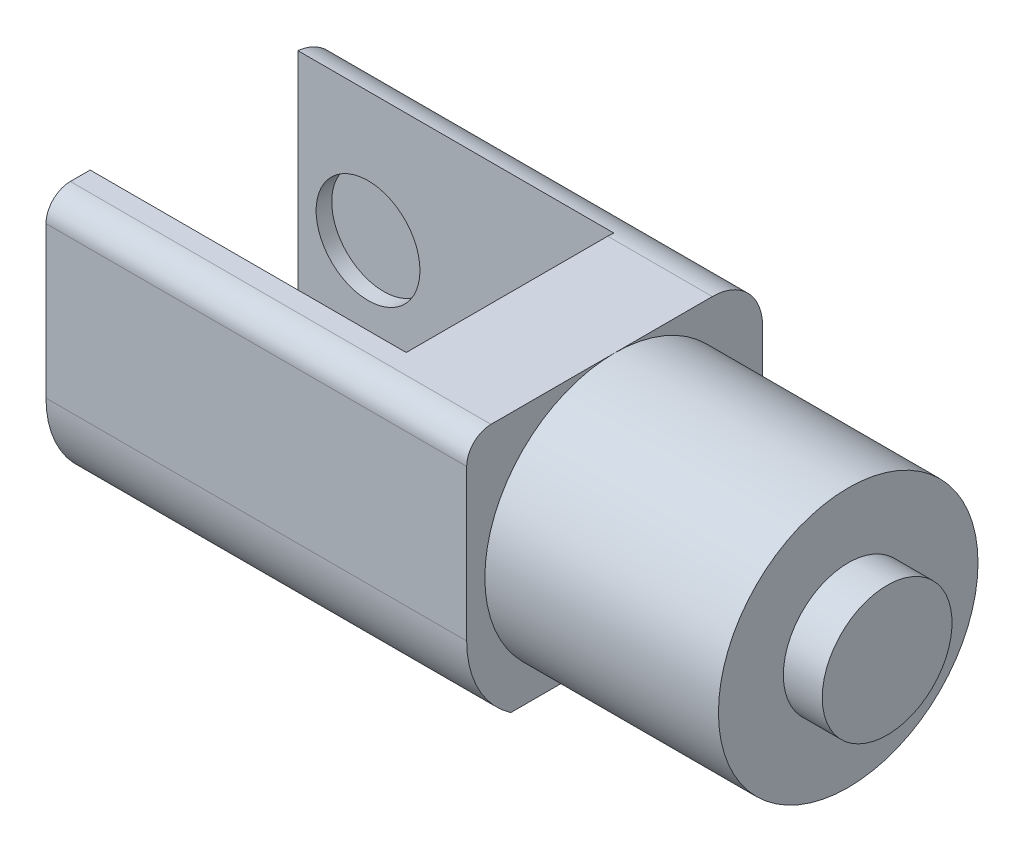
ISO-10303-21;
HEADER;
FILE_DESCRIPTION(('STEP AP214'),'2;1');
FILE_NAME('part.step','',(''),(''),'','','');
FILE_SCHEMA(('AUTOMOTIVE_DESIGN { 1 0 10303 214 1 1 1 1 }'));
ENDSEC;
DATA;
#1=APPLICATION_CONTEXT('core data for automotive mechanical design processes');
#2=APPLICATION_PROTOCOL_DEFINITION('international standard','automotive_design',2000,#1);
#3=PRODUCT_CONTEXT('',#1,'mechanical');
#4=PRODUCT('Part','Part','',(#3));
#5=PRODUCT_RELATED_PRODUCT_CATEGORY('part','',(#4));
#6=PRODUCT_DEFINITION_FORMATION('','',#4);
#7=PRODUCT_DEFINITION_CONTEXT('part definition',#1,'design');
#8=PRODUCT_DEFINITION('design','',#6,#7);
#9=PRODUCT_DEFINITION_SHAPE('','',#8);
#10=(LENGTH_UNIT() NAMED_UNIT(*) SI_UNIT(.MILLI.,.METRE.));
#11=(NAMED_UNIT(*) PLANE_ANGLE_UNIT() SI_UNIT($,.RADIAN.));
#12=(NAMED_UNIT(*) SI_UNIT($,.STERADIAN.) SOLID_ANGLE_UNIT());
#13=UNCERTAINTY_MEASURE_WITH_UNIT(LENGTH_MEASURE(1.E-05),#10,'distance_accuracy_value','');
#14=(GEOMETRIC_REPRESENTATION_CONTEXT(3) GLOBAL_UNCERTAINTY_ASSIGNED_CONTEXT((#13)) GLOBAL_UNIT_ASSIGNED_CONTEXT((#10,
#11,#12)) REPRESENTATION_CONTEXT('',''));
#15=CARTESIAN_POINT('',(0.,0.,0.));
#16=DIRECTION('',(0.,0.,1.));
#17=DIRECTION('',(1.,0.,0.));
#18=AXIS2_PLACEMENT_3D('',#15,#16,#17);
#19=CARTESIAN_POINT('',(22.86,0.,0.));
#20=DIRECTION('',(-1.,0.,0.));
#21=DIRECTION('',(0.,0.,1.));
#22=AXIS2_PLACEMENT_3D('',#19,#20,#21);
#23=CYLINDRICAL_SURFACE('',#22,12.7);
#24=CARTESIAN_POINT('',(22.86,0.,0.));
#25=DIRECTION('',(1.,0.,0.));
#26=DIRECTION('',(0.,0.,-1.));
#27=AXIS2_PLACEMENT_3D('',#24,#25,#26);
#28=CIRCLE('',#27,12.7);
#29=CARTESIAN_POINT('',(22.86,0.,-12.7));
#30=VERTEX_POINT('',#29);
#31=EDGE_CURVE('E178',#30,#30,#28,.T.);
#32=ORIENTED_EDGE('',*,*,#31,.F.);
#33=EDGE_LOOP('',(#32));
#34=FACE_BOUND('',#33,.T.);
#35=CARTESIAN_POINT('',(0.,0.,0.));
#36=DIRECTION('',(1.,0.,0.));
#37=DIRECTION('',(0.,0.,-1.));
#38=AXIS2_PLACEMENT_3D('',#35,#36,#37);
#39=CIRCLE('',#38,12.7);
#40=CARTESIAN_POINT('',(0.,12.7,0.));
#41=VERTEX_POINT('',#40);
#42=CARTESIAN_POINT('',(0.,-12.7,0.));
#43=VERTEX_POINT('',#42);
#44=EDGE_CURVE('E181',#41,#43,#39,.T.);
#45=ORIENTED_EDGE('',*,*,#44,.T.);
#46=EDGE_CURVE('E173',#43,#41,#39,.T.);
#47=ORIENTED_EDGE('',*,*,#46,.T.);
#48=EDGE_LOOP('',(#45,#47));
#49=FACE_BOUND('',#48,.T.);
#50=ADVANCED_FACE('F36',(#34,#49),#23,.T.);
#51=CARTESIAN_POINT('',(22.86,0.,0.));
#52=DIRECTION('',(1.,0.,0.));
#53=DIRECTION('',(0.,0.,-1.));
#54=AXIS2_PLACEMENT_3D('',#51,#52,#53);
#55=PLANE('',#54);
#56=CARTESIAN_POINT('',(22.86,0.,0.));
#57=DIRECTION('',(1.,0.,0.));
#58=DIRECTION('',(0.,0.,-1.));
#59=AXIS2_PLACEMENT_3D('',#56,#57,#58);
#60=CIRCLE('',#59,6.35);
#61=CARTESIAN_POINT('',(22.86,0.,6.35));
#62=VERTEX_POINT('',#61);
#63=EDGE_CURVE('E174',#62,#62,#60,.T.);
#64=ORIENTED_EDGE('',*,*,#63,.F.);
#65=EDGE_LOOP('',(#64));
#66=FACE_BOUND('',#65,.T.);
#67=ORIENTED_EDGE('',*,*,#31,.T.);
#68=EDGE_LOOP('',(#67));
#69=FACE_BOUND('',#68,.T.);
#70=ADVANCED_FACE('F292',(#66,#69),#55,.T.);
#71=CARTESIAN_POINT('',(26.67,0.,0.));
#72=DIRECTION('',(-1.,0.,0.));
#73=DIRECTION('',(0.,0.,1.));
#74=AXIS2_PLACEMENT_3D('',#71,#72,#73);
#75=CYLINDRICAL_SURFACE('',#74,6.35);
#76=CARTESIAN_POINT('',(26.67,0.,0.));
#77=DIRECTION('',(1.,0.,0.));
#78=DIRECTION('',(0.,0.,-1.));
#79=AXIS2_PLACEMENT_3D('',#76,#77,#78);
#80=CIRCLE('',#79,6.35);
#81=CARTESIAN_POINT('',(26.67,0.,6.35));
#82=VERTEX_POINT('',#81);
#83=EDGE_CURVE('E170',#82,#82,#80,.T.);
#84=CARTESIAN_POINT('',(26.67,0.,6.35));
#85=CARTESIAN_POINT('',(26.6303125,0.,6.35));
#86=CARTESIAN_POINT('',(26.590625,0.,6.35));
#87=CARTESIAN_POINT('',(26.51125,0.,6.35));
#88=CARTESIAN_POINT('',(26.4715625,0.,6.35));
#89=CARTESIAN_POINT('',(26.3921875,0.,6.35));
#90=CARTESIAN_POINT('',(26.3525,0.,6.35));
#91=CARTESIAN_POINT('',(26.273125,0.,6.35));
#92=CARTESIAN_POINT('',(26.2334375,0.,6.35));
#93=CARTESIAN_POINT('',(26.1540625,0.,6.35));
#94=CARTESIAN_POINT('',(26.114375,0.,6.35));
#95=CARTESIAN_POINT('',(26.035,0.,6.35));
#96=CARTESIAN_POINT('',(25.9953125,0.,6.35));
#97=CARTESIAN_POINT('',(25.9159375,0.,6.35));
#98=CARTESIAN_POINT('',(25.87625,0.,6.35));
#99=CARTESIAN_POINT('',(25.796875,0.,6.35));
#100=CARTESIAN_POINT('',(25.7571875,0.,6.35));
#101=CARTESIAN_POINT('',(25.6778125,0.,6.35));
#102=CARTESIAN_POINT('',(25.638125,0.,6.35));
#103=CARTESIAN_POINT('',(25.55875,0.,6.35));
#104=CARTESIAN_POINT('',(25.5190625,0.,6.35));
#105=CARTESIAN_POINT('',(25.4396875,0.,6.35));
#106=CARTESIAN_POINT('',(25.4,0.,6.35));
#107=CARTESIAN_POINT('',(25.320625,0.,6.35));
#108=CARTESIAN_POINT('',(25.2809375,0.,6.35));
#109=CARTESIAN_POINT('',(25.2015625,0.,6.35));
#110=CARTESIAN_POINT('',(25.161875,0.,6.35));
#111=CARTESIAN_POINT('',(25.0825,0.,6.35));
#112=CARTESIAN_POINT('',(25.0428125,0.,6.35));
#113=CARTESIAN_POINT('',(24.9634375,0.,6.35));
#114=CARTESIAN_POINT('',(24.92375,0.,6.35));
#115=CARTESIAN_POINT('',(24.844375,0.,6.35));
#116=CARTESIAN_POINT('',(24.8046875,0.,6.35));
#117=CARTESIAN_POINT('',(24.7253125,0.,6.35));
#118=CARTESIAN_POINT('',(24.685625,0.,6.35));
#119=CARTESIAN_POINT('',(24.60625,0.,6.35));
#120=CARTESIAN_POINT('',(24.5665625,0.,6.35));
#121=CARTESIAN_POINT('',(24.4871875,0.,6.35));
#122=CARTESIAN_POINT('',(24.4475,0.,6.35));
#123=CARTESIAN_POINT('',(24.368125,0.,6.35));
#124=CARTESIAN_POINT('',(24.3284375,0.,6.35));
#125=CARTESIAN_POINT('',(24.2490625,0.,6.35));
#126=CARTESIAN_POINT('',(24.209375,0.,6.35));
#127=CARTESIAN_POINT('',(24.13,0.,6.35));
#128=CARTESIAN_POINT('',(24.0903125,0.,6.35));
#129=CARTESIAN_POINT('',(24.0109375,0.,6.35));
#130=CARTESIAN_POINT('',(23.97125,0.,6.35));
#131=CARTESIAN_POINT('',(23.891875,0.,6.35));
#132=CARTESIAN_POINT('',(23.8521875,0.,6.35));
#133=CARTESIAN_POINT('',(23.7728125,0.,6.35));
#134=CARTESIAN_POINT('',(23.733125,0.,6.35));
#135=CARTESIAN_POINT('',(23.65375,0.,6.35));
#136=CARTESIAN_POINT('',(23.6140625,0.,6.35));
#137=CARTESIAN_POINT('',(23.5346875,0.,6.35));
#138=CARTESIAN_POINT('',(23.495,0.,6.35));
#139=CARTESIAN_POINT('',(23.415625,0.,6.35));
#140=CARTESIAN_POINT('',(23.3759375,0.,6.35));
#141=CARTESIAN_POINT('',(23.2965625,0.,6.35));
#142=CARTESIAN_POINT('',(23.256875,0.,6.35));
#143=CARTESIAN_POINT('',(23.1775,0.,6.35));
#144=CARTESIAN_POINT('',(23.1378125,0.,6.35));
#145=CARTESIAN_POINT('',(23.0584375,0.,6.35));
#146=CARTESIAN_POINT('',(23.01875,0.,6.35));
#147=CARTESIAN_POINT('',(22.939375,0.,6.35));
#148=CARTESIAN_POINT('',(22.8996875,0.,6.35));
#149=CARTESIAN_POINT('',(22.86,0.,6.35));
#150=B_SPLINE_CURVE_WITH_KNOTS('',3,(#84,#85,#86,#87,#88,#89,#90,#91,#92,#93,#94,#95,#96,#97,
#98,#99,#100,#101,#102,#103,#104,#105,#106,#107,#108,#109,#110,#111,#112,#113,#114,#115,#116,
#117,#118,#119,#120,#121,#122,#123,#124,#125,#126,#127,#128,#129,#130,#131,#132,#133,#134,#135,
#136,#137,#138,#139,#140,#141,#142,#143,#144,#145,#146,#147,#148,#149),.UNSPECIFIED.,.F.,.F.,(4,
2,2,2,2,2,2,2,2,2,2,2,2,2,2,2,2,2,2,2,2,2,2,2,2,2,2,2,2,2,2,2,4),(0.,0.119062500000003,
0.238125000000002,0.357187500000002,0.476250000000001,0.5953125,0.714375000000003,
0.833437500000003,0.952500000000002,1.0715625,1.190625,1.3096875,1.42875,1.5478125,1.666875,
1.7859375,1.905,2.0240625,2.143125,2.2621875,2.38125,2.5003125,2.619375,2.7384375,2.8575,
2.9765625,3.095625,3.2146875,3.33375,3.4528125,3.571875,3.6909375,3.81),.UNSPECIFIED.);
#151=EDGE_CURVE('BSEAM298',#82,#62,#150,.T.);
#152=ORIENTED_EDGE('',*,*,#83,.F.);
#153=ORIENTED_EDGE('',*,*,#63,.T.);
#154=ORIENTED_EDGE('',*,*,#151,.T.);
#155=ORIENTED_EDGE('',*,*,#151,.F.);
#156=EDGE_LOOP('',(#152,#154,#153,#155));
#157=FACE_BOUND('',#156,.T.);
#158=ADVANCED_FACE('F298',(#157),#75,.T.);
#159=CARTESIAN_POINT('',(26.67,0.,0.));
#160=DIRECTION('',(1.,0.,0.));
#161=DIRECTION('',(0.,0.,-1.));
#162=AXIS2_PLACEMENT_3D('',#159,#160,#161);
#163=PLANE('',#162);
#164=ORIENTED_EDGE('',*,*,#83,.T.);
#165=EDGE_LOOP('',(#164));
#166=FACE_BOUND('',#165,.T.);
#167=ADVANCED_FACE('F365',(#166),#163,.T.);
#168=CARTESIAN_POINT('',(0.,12.7,14.478));
#169=DIRECTION('',(-1.,0.,0.));
#170=DIRECTION('',(0.,0.,1.));
#171=AXIS2_PLACEMENT_3D('',#168,#169,#170);
#172=PLANE('',#171);
#173=DIRECTION('',(0.,1.,0.));
#174=VECTOR('',#173,1.);
#175=CARTESIAN_POINT('',(0.,12.7,14.478));
#176=LINE('',#175,#174);
#177=CARTESIAN_POINT('',(0.,-4.47109509108289,14.478));
#178=VERTEX_POINT('',#177);
#179=CARTESIAN_POINT('',(0.,10.319999934,14.478));
#180=VERTEX_POINT('',#179);
#181=EDGE_CURVE('E164',#178,#180,#176,.T.);
#182=ORIENTED_EDGE('',*,*,#181,.F.);
#183=CARTESIAN_POINT('',(0.,-4.47109509108289,4.478));
#184=DIRECTION('',(-1.,0.,0.));
#185=DIRECTION('',(0.,0.,1.));
#186=AXIS2_PLACEMENT_3D('',#183,#184,#185);
#187=CIRCLE('',#186,10.);
#188=CARTESIAN_POINT('',(0.,-12.7,10.16));
#189=VERTEX_POINT('',#188);
#190=EDGE_CURVE('E196',#178,#189,#187,.F.);
#191=ORIENTED_EDGE('',*,*,#190,.T.);
#192=DIRECTION('',(0.,0.,1.));
#193=VECTOR('',#192,1.);
#194=CARTESIAN_POINT('',(0.,-12.7,-10.16));
#195=LINE('',#194,#193);
#196=EDGE_CURVE('E157',#43,#189,#195,.T.);
#197=ORIENTED_EDGE('',*,*,#196,.F.);
#198=ORIENTED_EDGE('',*,*,#44,.F.);
#199=DIRECTION('',(0.,0.,-1.));
#200=VECTOR('',#199,1.);
#201=CARTESIAN_POINT('',(0.,12.7,14.478));
#202=LINE('',#201,#200);
#203=CARTESIAN_POINT('',(0.,12.7,12.097999934));
#204=VERTEX_POINT('',#203);
#205=EDGE_CURVE('E167',#204,#41,#202,.T.);
#206=ORIENTED_EDGE('',*,*,#205,.F.);
#207=CARTESIAN_POINT('',(0.,10.319999934,12.097999934));
#208=DIRECTION('',(-1.,0.,0.));
#209=DIRECTION('',(0.,0.,1.));
#210=AXIS2_PLACEMENT_3D('',#207,#208,#209);
#211=CIRCLE('',#210,2.380000066);
#212=EDGE_CURVE('E190',#204,#180,#211,.F.);
#213=ORIENTED_EDGE('',*,*,#212,.T.);
#214=EDGE_LOOP('',(#182,#191,#197,#198,#206,#213));
#215=FACE_BOUND('',#214,.T.);
#216=ADVANCED_FACE('F266',(#215),#172,.F.);
#217=CARTESIAN_POINT('',(0.,12.7,14.478));
#218=DIRECTION('',(0.,-1.,0.));
#219=DIRECTION('',(0.,0.,-1.));
#220=AXIS2_PLACEMENT_3D('',#217,#218,#219);
#221=PLANE('',#220);
#222=DIRECTION('',(0.,0.,1.));
#223=VECTOR('',#222,1.);
#224=CARTESIAN_POINT('',(0.,12.7,-10.16));
#225=LINE('',#224,#223);
#226=CARTESIAN_POINT('',(0.,12.7,-9.558));
#227=VERTEX_POINT('',#226);
#228=EDGE_CURVE('E138',#227,#41,#225,.T.);
#229=ORIENTED_EDGE('',*,*,#228,.F.);
#230=DIRECTION('',(-1.,0.,0.));
#231=VECTOR('',#230,1.);
#232=CARTESIAN_POINT('',(0.,12.7,-9.558));
#233=LINE('',#232,#231);
#234=CARTESIAN_POINT('',(-10.2346075258879,12.7,-9.558));
#235=VERTEX_POINT('',#234);
#236=EDGE_CURVE('E136',#227,#235,#233,.T.);
#237=ORIENTED_EDGE('',*,*,#236,.T.);
#238=DIRECTION('',(0.,0.,1.));
#239=VECTOR('',#238,1.);
#240=CARTESIAN_POINT('',(-10.2346075258879,12.7,-10.16));
#241=LINE('',#240,#239);
#242=CARTESIAN_POINT('',(-10.2346075258879,12.7,10.16));
#243=VERTEX_POINT('',#242);
#244=EDGE_CURVE('E127',#235,#243,#241,.T.);
#245=ORIENTED_EDGE('',*,*,#244,.T.);
#246=DIRECTION('',(-1.,0.,0.));
#247=VECTOR('',#246,1.);
#248=CARTESIAN_POINT('',(0.,12.7,10.16));
#249=LINE('',#248,#247);
#250=CARTESIAN_POINT('',(-41.1678596910677,12.7,10.16));
#251=VERTEX_POINT('',#250);
#252=EDGE_CURVE('E133',#243,#251,#249,.T.);
#253=ORIENTED_EDGE('',*,*,#252,.T.);
#254=DIRECTION('',(0.,0.,-1.));
#255=VECTOR('',#254,1.);
#256=CARTESIAN_POINT('',(-41.1678596910677,12.7,14.478));
#257=LINE('',#256,#255);
#258=CARTESIAN_POINT('',(-41.1678596910677,12.7,12.097999934));
#259=VERTEX_POINT('',#258);
#260=EDGE_CURVE('E165',#259,#251,#257,.T.);
#261=ORIENTED_EDGE('',*,*,#260,.F.);
#262=DIRECTION('',(-1.,0.,0.));
#263=VECTOR('',#262,1.);
#264=CARTESIAN_POINT('',(0.,12.7,12.097999934));
#265=LINE('',#264,#263);
#266=EDGE_CURVE('E188',#259,#204,#265,.F.);
#267=ORIENTED_EDGE('',*,*,#266,.T.);
#268=ORIENTED_EDGE('',*,*,#205,.T.);
#269=EDGE_LOOP('',(#229,#237,#245,#253,#261,#267,#268));
#270=FACE_BOUND('',#269,.T.);
#271=ADVANCED_FACE('F130',(#270),#221,.F.);
#272=CARTESIAN_POINT('',(-41.1678596910677,12.7,14.478));
#273=DIRECTION('',(1.,0.,0.));
#274=DIRECTION('',(0.,0.,-1.));
#275=AXIS2_PLACEMENT_3D('',#272,#273,#274);
#276=PLANE('',#275);
#277=DIRECTION('',(0.,-1.,0.));
#278=VECTOR('',#277,1.);
#279=CARTESIAN_POINT('',(-41.1678596910677,12.7,10.16));
#280=LINE('',#279,#278);
#281=CARTESIAN_POINT('',(-41.1678596910677,-12.7,10.16));
#282=VERTEX_POINT('',#281);
#283=EDGE_CURVE('E152',#251,#282,#280,.T.);
#284=ORIENTED_EDGE('',*,*,#283,.T.);
#285=CARTESIAN_POINT('',(-41.1678596910677,-4.47109509108289,4.478));
#286=DIRECTION('',(1.,0.,0.));
#287=DIRECTION('',(0.,0.,-1.));
#288=AXIS2_PLACEMENT_3D('',#285,#286,#287);
#289=CIRCLE('',#288,10.);
#290=CARTESIAN_POINT('',(-41.1678596910677,-4.47109509108289,14.478));
#291=VERTEX_POINT('',#290);
#292=EDGE_CURVE('E199',#282,#291,#289,.F.);
#293=ORIENTED_EDGE('',*,*,#292,.T.);
#294=DIRECTION('',(0.,-1.,0.));
#295=VECTOR('',#294,1.);
#296=CARTESIAN_POINT('',(-41.1678596910677,12.7,14.478));
#297=LINE('',#296,#295);
#298=CARTESIAN_POINT('',(-41.1678596910677,10.319999934,14.478));
#299=VERTEX_POINT('',#298);
#300=EDGE_CURVE('E160',#299,#291,#297,.T.);
#301=ORIENTED_EDGE('',*,*,#300,.F.);
#302=CARTESIAN_POINT('',(-41.1678596910677,10.319999934,12.097999934));
#303=DIRECTION('',(1.,0.,0.));
#304=DIRECTION('',(0.,0.,-1.));
#305=AXIS2_PLACEMENT_3D('',#302,#303,#304);
#306=CIRCLE('',#305,2.380000066);
#307=EDGE_CURVE('E186',#299,#259,#306,.F.);
#308=ORIENTED_EDGE('',*,*,#307,.T.);
#309=ORIENTED_EDGE('',*,*,#260,.T.);
#310=EDGE_LOOP('',(#284,#293,#301,#308,#309));
#311=FACE_BOUND('',#310,.T.);
#312=ADVANCED_FACE('F273',(#311),#276,.F.);
#313=CARTESIAN_POINT('',(0.,0.,14.478));
#314=DIRECTION('',(0.,0.,-1.));
#315=DIRECTION('',(-1.,0.,0.));
#316=AXIS2_PLACEMENT_3D('',#313,#314,#315);
#317=PLANE('',#316);
#318=ORIENTED_EDGE('',*,*,#300,.T.);
#319=DIRECTION('',(-1.,0.,0.));
#320=VECTOR('',#319,1.);
#321=CARTESIAN_POINT('',(0.,-4.47109509108289,14.478));
#322=LINE('',#321,#320);
#323=EDGE_CURVE('E193',#291,#178,#322,.F.);
#324=ORIENTED_EDGE('',*,*,#323,.T.);
#325=ORIENTED_EDGE('',*,*,#181,.T.);
#326=DIRECTION('',(-1.,0.,0.));
#327=VECTOR('',#326,1.);
#328=CARTESIAN_POINT('',(0.,10.319999934,14.478));
#329=LINE('',#328,#327);
#330=EDGE_CURVE('E177',#180,#299,#329,.T.);
#331=ORIENTED_EDGE('',*,*,#330,.T.);
#332=EDGE_LOOP('',(#318,#324,#325,#331));
#333=FACE_BOUND('',#332,.T.);
#334=ADVANCED_FACE('F258',(#333),#317,.F.);
#335=CARTESIAN_POINT('',(0.,0.,10.16));
#336=DIRECTION('',(0.,0.,-1.));
#337=DIRECTION('',(-1.,0.,0.));
#338=AXIS2_PLACEMENT_3D('',#335,#336,#337);
#339=PLANE('',#338);
#340=CARTESIAN_POINT('',(-34.29,0.,10.16));
#341=DIRECTION('',(0.,0.,1.));
#342=DIRECTION('',(1.,0.,0.));
#343=AXIS2_PLACEMENT_3D('',#340,#341,#342);
#344=CIRCLE('',#343,5.08);
#345=CARTESIAN_POINT('',(-39.37,0.,10.16));
#346=VERTEX_POINT('',#345);
#347=EDGE_CURVE('E339',#346,#346,#344,.T.);
#348=ORIENTED_EDGE('',*,*,#347,.T.);
#349=EDGE_LOOP('',(#348));
#350=FACE_BOUND('',#349,.T.);
#351=DIRECTION('',(0.,-1.,0.));
#352=VECTOR('',#351,1.);
#353=CARTESIAN_POINT('',(-10.2346075258879,12.7,10.16));
#354=LINE('',#353,#352);
#355=CARTESIAN_POINT('',(-10.2346075258879,-12.7,10.16));
#356=VERTEX_POINT('',#355);
#357=EDGE_CURVE('E141',#243,#356,#354,.T.);
#358=ORIENTED_EDGE('',*,*,#357,.T.);
#359=DIRECTION('',(1.,0.,0.));
#360=VECTOR('',#359,1.);
#361=CARTESIAN_POINT('',(0.,-12.7,10.16));
#362=LINE('',#361,#360);
#363=EDGE_CURVE('E155',#282,#356,#362,.T.);
#364=ORIENTED_EDGE('',*,*,#363,.F.);
#365=ORIENTED_EDGE('',*,*,#283,.F.);
#366=ORIENTED_EDGE('',*,*,#252,.F.);
#367=EDGE_LOOP('',(#358,#364,#365,#366));
#368=FACE_BOUND('',#367,.T.);
#369=ADVANCED_FACE('F151',(#350,#368),#339,.T.);
#370=CARTESIAN_POINT('',(0.,10.319999934,12.097999934));
#371=DIRECTION('',(-1.,0.,0.));
#372=DIRECTION('',(0.,0.,1.));
#373=AXIS2_PLACEMENT_3D('',#370,#371,#372);
#374=CYLINDRICAL_SURFACE('',#373,2.380000066);
#375=ORIENTED_EDGE('',*,*,#212,.F.);
#376=ORIENTED_EDGE('',*,*,#266,.F.);
#377=ORIENTED_EDGE('',*,*,#307,.F.);
#378=ORIENTED_EDGE('',*,*,#330,.F.);
#379=EDGE_LOOP('',(#375,#376,#377,#378));
#380=FACE_BOUND('',#379,.T.);
#381=ADVANCED_FACE('F272',(#380),#374,.T.);
#382=CARTESIAN_POINT('',(0.,-4.47109509108289,4.478));
#383=DIRECTION('',(-1.,0.,0.));
#384=DIRECTION('',(0.,0.,1.));
#385=AXIS2_PLACEMENT_3D('',#382,#383,#384);
#386=CYLINDRICAL_SURFACE('',#385,10.);
#387=ORIENTED_EDGE('',*,*,#292,.F.);
#388=ORIENTED_EDGE('',*,*,#363,.T.);
#389=DIRECTION('',(1.,0.,0.));
#390=VECTOR('',#389,1.);
#391=CARTESIAN_POINT('',(0.,-12.7,10.16));
#392=LINE('',#391,#390);
#393=EDGE_CURVE('E147',#356,#189,#392,.T.);
#394=ORIENTED_EDGE('',*,*,#393,.T.);
#395=ORIENTED_EDGE('',*,*,#190,.F.);
#396=ORIENTED_EDGE('',*,*,#323,.F.);
#397=EDGE_LOOP('',(#387,#388,#394,#395,#396));
#398=FACE_BOUND('',#397,.T.);
#399=ADVANCED_FACE('F263',(#398),#386,.T.);
#400=CARTESIAN_POINT('',(0.,12.7,-10.16));
#401=DIRECTION('',(1.,0.,0.));
#402=DIRECTION('',(0.,0.,-1.));
#403=AXIS2_PLACEMENT_3D('',#400,#401,#402);
#404=PLANE('',#403);
#405=CARTESIAN_POINT('',(0.,-12.7,-9.558));
#406=VERTEX_POINT('',#405);
#407=EDGE_CURVE('E153',#406,#43,#195,.T.);
#408=ORIENTED_EDGE('',*,*,#407,.F.);
#409=CARTESIAN_POINT('',(0.,-7.78,-9.558));
#410=DIRECTION('',(1.,0.,0.));
#411=DIRECTION('',(0.,0.,-1.));
#412=AXIS2_PLACEMENT_3D('',#409,#410,#411);
#413=CIRCLE('',#412,4.92);
#414=CARTESIAN_POINT('',(0.,-7.78,-14.478));
#415=VERTEX_POINT('',#414);
#416=EDGE_CURVE('E11',#406,#415,#413,.T.);
#417=ORIENTED_EDGE('',*,*,#416,.T.);
#418=DIRECTION('',(0.,-1.,0.));
#419=VECTOR('',#418,1.);
#420=CARTESIAN_POINT('',(0.,12.7,-14.478));
#421=LINE('',#420,#419);
#422=CARTESIAN_POINT('',(0.,7.78,-14.478));
#423=VERTEX_POINT('',#422);
#424=EDGE_CURVE('E148',#423,#415,#421,.T.);
#425=ORIENTED_EDGE('',*,*,#424,.F.);
#426=CARTESIAN_POINT('',(0.,7.78,-9.558));
#427=DIRECTION('',(1.,0.,0.));
#428=DIRECTION('',(0.,0.,-1.));
#429=AXIS2_PLACEMENT_3D('',#426,#427,#428);
#430=CIRCLE('',#429,4.92);
#431=EDGE_CURVE('E210',#423,#227,#430,.T.);
#432=ORIENTED_EDGE('',*,*,#431,.T.);
#433=ORIENTED_EDGE('',*,*,#228,.T.);
#434=ORIENTED_EDGE('',*,*,#46,.F.);
#435=EDGE_LOOP('',(#408,#417,#425,#432,#433,#434));
#436=FACE_BOUND('',#435,.T.);
#437=ADVANCED_FACE('F235',(#436),#404,.T.);
#438=CARTESIAN_POINT('',(0.,-12.7,-10.16));
#439=DIRECTION('',(0.,-1.,0.));
#440=DIRECTION('',(0.,0.,-1.));
#441=AXIS2_PLACEMENT_3D('',#438,#439,#440);
#442=PLANE('',#441);
#443=DIRECTION('',(0.,0.,1.));
#444=VECTOR('',#443,1.);
#445=CARTESIAN_POINT('',(-10.2346075258879,-12.7,-10.16));
#446=LINE('',#445,#444);
#447=CARTESIAN_POINT('',(-10.2346075258879,-12.7,-9.558));
#448=VERTEX_POINT('',#447);
#449=EDGE_CURVE('E137',#448,#356,#446,.T.);
#450=ORIENTED_EDGE('',*,*,#449,.F.);
#451=DIRECTION('',(-1.,0.,0.));
#452=VECTOR('',#451,1.);
#453=CARTESIAN_POINT('',(0.,-12.7,-9.558));
#454=LINE('',#453,#452);
#455=EDGE_CURVE('E44',#448,#406,#454,.F.);
#456=ORIENTED_EDGE('',*,*,#455,.T.);
#457=ORIENTED_EDGE('',*,*,#407,.T.);
#458=ORIENTED_EDGE('',*,*,#196,.T.);
#459=ORIENTED_EDGE('',*,*,#393,.F.);
#460=EDGE_LOOP('',(#450,#456,#457,#458,#459));
#461=FACE_BOUND('',#460,.T.);
#462=ADVANCED_FACE('F287',(#461),#442,.T.);
#463=CARTESIAN_POINT('',(-10.2346075258879,12.7,-10.16));
#464=DIRECTION('',(-1.,0.,0.));
#465=DIRECTION('',(0.,0.,1.));
#466=AXIS2_PLACEMENT_3D('',#463,#464,#465);
#467=PLANE('',#466);
#468=DIRECTION('',(0.,-1.,0.));
#469=VECTOR('',#468,1.);
#470=CARTESIAN_POINT('',(-10.2346075258879,12.7,-10.16));
#471=LINE('',#470,#469);
#472=CARTESIAN_POINT('',(-10.2346075258879,12.6630314354917,-10.16));
#473=VERTEX_POINT('',#472);
#474=CARTESIAN_POINT('',(-10.2346075258879,-12.6630314354917,-10.16));
#475=VERTEX_POINT('',#474);
#476=EDGE_CURVE('E224',#473,#475,#471,.T.);
#477=ORIENTED_EDGE('',*,*,#476,.T.);
#478=CARTESIAN_POINT('',(-10.2346075258879,-7.78,-9.558));
#479=DIRECTION('',(-1.,0.,0.));
#480=DIRECTION('',(0.,0.,1.));
#481=AXIS2_PLACEMENT_3D('',#478,#479,#480);
#482=CIRCLE('',#481,4.92);
#483=EDGE_CURVE('E58',#475,#448,#482,.T.);
#484=ORIENTED_EDGE('',*,*,#483,.T.);
#485=ORIENTED_EDGE('',*,*,#449,.T.);
#486=ORIENTED_EDGE('',*,*,#357,.F.);
#487=ORIENTED_EDGE('',*,*,#244,.F.);
#488=CARTESIAN_POINT('',(-10.2346075258879,7.78,-9.558));
#489=DIRECTION('',(-1.,0.,0.));
#490=DIRECTION('',(0.,0.,1.));
#491=AXIS2_PLACEMENT_3D('',#488,#489,#490);
#492=CIRCLE('',#491,4.92);
#493=EDGE_CURVE('E202',#235,#473,#492,.T.);
#494=ORIENTED_EDGE('',*,*,#493,.T.);
#495=EDGE_LOOP('',(#477,#484,#485,#486,#487,#494));
#496=FACE_BOUND('',#495,.T.);
#497=ADVANCED_FACE('F142',(#496),#467,.T.);
#498=CARTESIAN_POINT('',(-41.1678596910677,12.7,-14.478));
#499=DIRECTION('',(-1.,0.,0.));
#500=DIRECTION('',(0.,0.,1.));
#501=AXIS2_PLACEMENT_3D('',#498,#499,#500);
#502=PLANE('',#501);
#503=DIRECTION('',(0.,-1.,0.));
#504=VECTOR('',#503,1.);
#505=CARTESIAN_POINT('',(-41.1678596910677,12.7,-14.478));
#506=LINE('',#505,#504);
#507=CARTESIAN_POINT('',(-41.1678596910677,7.78,-14.478));
#508=VERTEX_POINT('',#507);
#509=CARTESIAN_POINT('',(-41.1678596910677,-7.78,-14.478));
#510=VERTEX_POINT('',#509);
#511=EDGE_CURVE('E243',#508,#510,#506,.T.);
#512=ORIENTED_EDGE('',*,*,#511,.T.);
#513=CARTESIAN_POINT('',(-41.1678596910677,-7.78,-9.558));
#514=DIRECTION('',(-1.,0.,0.));
#515=DIRECTION('',(0.,0.,1.));
#516=AXIS2_PLACEMENT_3D('',#513,#514,#515);
#517=CIRCLE('',#516,4.92);
#518=CARTESIAN_POINT('',(-41.1678596910677,-12.6630314354917,-10.16));
#519=VERTEX_POINT('',#518);
#520=EDGE_CURVE('E215',#510,#519,#517,.T.);
#521=ORIENTED_EDGE('',*,*,#520,.T.);
#522=DIRECTION('',(0.,-1.,0.));
#523=VECTOR('',#522,1.);
#524=CARTESIAN_POINT('',(-41.1678596910677,12.7,-10.16));
#525=LINE('',#524,#523);
#526=CARTESIAN_POINT('',(-41.1678596910677,12.6630314354917,-10.16));
#527=VERTEX_POINT('',#526);
#528=EDGE_CURVE('E227',#527,#519,#525,.T.);
#529=ORIENTED_EDGE('',*,*,#528,.F.);
#530=CARTESIAN_POINT('',(-41.1678596910677,7.78,-9.558));
#531=DIRECTION('',(-1.,0.,0.));
#532=DIRECTION('',(0.,0.,1.));
#533=AXIS2_PLACEMENT_3D('',#530,#531,#532);
#534=CIRCLE('',#533,4.92);
#535=EDGE_CURVE('E206',#527,#508,#534,.T.);
#536=ORIENTED_EDGE('',*,*,#535,.T.);
#537=EDGE_LOOP('',(#512,#521,#529,#536));
#538=FACE_BOUND('',#537,.T.);
#539=ADVANCED_FACE('F279',(#538),#502,.T.);
#540=CARTESIAN_POINT('',(0.,0.,-14.478));
#541=DIRECTION('',(0.,0.,1.));
#542=DIRECTION('',(1.,0.,0.));
#543=AXIS2_PLACEMENT_3D('',#540,#541,#542);
#544=PLANE('',#543);
#545=ORIENTED_EDGE('',*,*,#424,.T.);
#546=DIRECTION('',(-1.,0.,0.));
#547=VECTOR('',#546,1.);
#548=CARTESIAN_POINT('',(-41.1678596910677,-7.78,-14.478));
#549=LINE('',#548,#547);
#550=EDGE_CURVE('E212',#415,#510,#549,.T.);
#551=ORIENTED_EDGE('',*,*,#550,.T.);
#552=ORIENTED_EDGE('',*,*,#511,.F.);
#553=DIRECTION('',(-1.,0.,0.));
#554=VECTOR('',#553,1.);
#555=CARTESIAN_POINT('',(0.,7.78,-14.478));
#556=LINE('',#555,#554);
#557=EDGE_CURVE('E208',#508,#423,#556,.F.);
#558=ORIENTED_EDGE('',*,*,#557,.T.);
#559=EDGE_LOOP('',(#545,#551,#552,#558));
#560=FACE_BOUND('',#559,.T.);
#561=ADVANCED_FACE('F239',(#560),#544,.F.);
#562=CARTESIAN_POINT('',(0.,0.,-10.16));
#563=DIRECTION('',(0.,0.,1.));
#564=DIRECTION('',(1.,0.,0.));
#565=AXIS2_PLACEMENT_3D('',#562,#563,#564);
#566=PLANE('',#565);
#567=CARTESIAN_POINT('',(-34.29,0.,-10.16));
#568=DIRECTION('',(0.,0.,1.));
#569=DIRECTION('',(1.,0.,0.));
#570=AXIS2_PLACEMENT_3D('',#567,#568,#569);
#571=CIRCLE('',#570,5.08);
#572=CARTESIAN_POINT('',(-29.21,0.,-10.16));
#573=VERTEX_POINT('',#572);
#574=EDGE_CURVE('E338',#573,#573,#571,.T.);
#575=ORIENTED_EDGE('',*,*,#574,.F.);
#576=EDGE_LOOP('',(#575));
#577=FACE_BOUND('',#576,.T.);
#578=ORIENTED_EDGE('',*,*,#528,.T.);
#579=DIRECTION('',(1.,0.,0.));
#580=VECTOR('',#579,1.);
#581=CARTESIAN_POINT('',(-41.1678596910677,-12.6630314354917,-10.16));
#582=LINE('',#581,#580);
#583=EDGE_CURVE('E217',#519,#475,#582,.T.);
#584=ORIENTED_EDGE('',*,*,#583,.T.);
#585=ORIENTED_EDGE('',*,*,#476,.F.);
#586=DIRECTION('',(-1.,0.,0.));
#587=VECTOR('',#586,1.);
#588=CARTESIAN_POINT('',(-10.2346075258879,12.6630314354917,-10.16));
#589=LINE('',#588,#587);
#590=EDGE_CURVE('E204',#473,#527,#589,.T.);
#591=ORIENTED_EDGE('',*,*,#590,.T.);
#592=EDGE_LOOP('',(#578,#584,#585,#591));
#593=FACE_BOUND('',#592,.T.);
#594=ADVANCED_FACE('F223',(#577,#593),#566,.T.);
#595=CARTESIAN_POINT('',(0.,7.78,-9.558));
#596=DIRECTION('',(-1.,0.,0.));
#597=DIRECTION('',(0.,0.,1.));
#598=AXIS2_PLACEMENT_3D('',#595,#596,#597);
#599=CYLINDRICAL_SURFACE('',#598,4.92);
#600=ORIENTED_EDGE('',*,*,#431,.F.);
#601=ORIENTED_EDGE('',*,*,#557,.F.);
#602=ORIENTED_EDGE('',*,*,#535,.F.);
#603=ORIENTED_EDGE('',*,*,#590,.F.);
#604=ORIENTED_EDGE('',*,*,#493,.F.);
#605=ORIENTED_EDGE('',*,*,#236,.F.);
#606=EDGE_LOOP('',(#600,#601,#602,#603,#604,#605));
#607=FACE_BOUND('',#606,.T.);
#608=ADVANCED_FACE('F276',(#607),#599,.T.);
#609=CARTESIAN_POINT('',(0.,-7.78,-9.558));
#610=DIRECTION('',(1.,0.,0.));
#611=DIRECTION('',(0.,0.,-1.));
#612=AXIS2_PLACEMENT_3D('',#609,#610,#611);
#613=CYLINDRICAL_SURFACE('',#612,4.92);
#614=ORIENTED_EDGE('',*,*,#416,.F.);
#615=ORIENTED_EDGE('',*,*,#455,.F.);
#616=ORIENTED_EDGE('',*,*,#483,.F.);
#617=ORIENTED_EDGE('',*,*,#583,.F.);
#618=ORIENTED_EDGE('',*,*,#520,.F.);
#619=ORIENTED_EDGE('',*,*,#550,.F.);
#620=EDGE_LOOP('',(#614,#615,#616,#617,#618,#619));
#621=FACE_BOUND('',#620,.T.);
#622=ADVANCED_FACE('F38',(#621),#613,.T.);
#623=CARTESIAN_POINT('',(-34.29,0.,-11.684));
#624=DIRECTION('',(0.,0.,1.));
#625=DIRECTION('',(1.,0.,0.));
#626=AXIS2_PLACEMENT_3D('',#623,#624,#625);
#627=CYLINDRICAL_SURFACE('',#626,5.08);
#628=CARTESIAN_POINT('',(-34.29,0.,-11.684));
#629=DIRECTION('',(0.,0.,1.));
#630=DIRECTION('',(1.,0.,0.));
#631=AXIS2_PLACEMENT_3D('',#628,#629,#630);
#632=CIRCLE('',#631,5.08);
#633=CARTESIAN_POINT('',(-29.21,0.,-11.684));
#634=VERTEX_POINT('',#633);
#635=EDGE_CURVE('E248',#634,#634,#632,.T.);
#636=CARTESIAN_POINT('',(-29.21,0.,-11.684));
#637=CARTESIAN_POINT('',(-29.21,0.,-11.668125));
#638=CARTESIAN_POINT('',(-29.21,0.,-11.65225));
#639=CARTESIAN_POINT('',(-29.21,0.,-11.6205));
#640=CARTESIAN_POINT('',(-29.21,0.,-11.604625));
#641=CARTESIAN_POINT('',(-29.21,0.,-11.572875));
#642=CARTESIAN_POINT('',(-29.21,0.,-11.557));
#643=CARTESIAN_POINT('',(-29.21,0.,-11.52525));
#644=CARTESIAN_POINT('',(-29.21,0.,-11.509375));
#645=CARTESIAN_POINT('',(-29.21,0.,-11.477625));
#646=CARTESIAN_POINT('',(-29.21,0.,-11.46175));
#647=CARTESIAN_POINT('',(-29.21,0.,-11.43));
#648=CARTESIAN_POINT('',(-29.21,0.,-11.414125));
#649=CARTESIAN_POINT('',(-29.21,0.,-11.382375));
#650=CARTESIAN_POINT('',(-29.21,0.,-11.3665));
#651=CARTESIAN_POINT('',(-29.21,0.,-11.33475));
#652=CARTESIAN_POINT('',(-29.21,0.,-11.318875));
#653=CARTESIAN_POINT('',(-29.21,0.,-11.287125));
#654=CARTESIAN_POINT('',(-29.21,0.,-11.27125));
#655=CARTESIAN_POINT('',(-29.21,0.,-11.2395));
#656=CARTESIAN_POINT('',(-29.21,0.,-11.223625));
#657=CARTESIAN_POINT('',(-29.21,0.,-11.191875));
#658=CARTESIAN_POINT('',(-29.21,0.,-11.176));
#659=CARTESIAN_POINT('',(-29.21,0.,-11.14425));
#660=CARTESIAN_POINT('',(-29.21,0.,-11.128375));
#661=CARTESIAN_POINT('',(-29.21,0.,-11.096625));
#662=CARTESIAN_POINT('',(-29.21,0.,-11.08075));
#663=CARTESIAN_POINT('',(-29.21,0.,-11.049));
#664=CARTESIAN_POINT('',(-29.21,0.,-11.033125));
#665=CARTESIAN_POINT('',(-29.21,0.,-11.001375));
#666=CARTESIAN_POINT('',(-29.21,0.,-10.9855));
#667=CARTESIAN_POINT('',(-29.21,0.,-10.95375));
#668=CARTESIAN_POINT('',(-29.21,0.,-10.937875));
#669=CARTESIAN_POINT('',(-29.21,0.,-10.906125));
#670=CARTESIAN_POINT('',(-29.21,0.,-10.89025));
#671=CARTESIAN_POINT('',(-29.21,0.,-10.8585));
#672=CARTESIAN_POINT('',(-29.21,0.,-10.842625));
#673=CARTESIAN_POINT('',(-29.21,0.,-10.810875));
#674=CARTESIAN_POINT('',(-29.21,0.,-10.795));
#675=CARTESIAN_POINT('',(-29.21,0.,-10.76325));
#676=CARTESIAN_POINT('',(-29.21,0.,-10.747375));
#677=CARTESIAN_POINT('',(-29.21,0.,-10.715625));
#678=CARTESIAN_POINT('',(-29.21,0.,-10.69975));
#679=CARTESIAN_POINT('',(-29.21,0.,-10.668));
#680=CARTESIAN_POINT('',(-29.21,0.,-10.652125));
#681=CARTESIAN_POINT('',(-29.21,0.,-10.620375));
#682=CARTESIAN_POINT('',(-29.21,0.,-10.6045));
#683=CARTESIAN_POINT('',(-29.21,0.,-10.57275));
#684=CARTESIAN_POINT('',(-29.21,0.,-10.556875));
#685=CARTESIAN_POINT('',(-29.21,0.,-10.525125));
#686=CARTESIAN_POINT('',(-29.21,0.,-10.50925));
#687=CARTESIAN_POINT('',(-29.21,0.,-10.4775));
#688=CARTESIAN_POINT('',(-29.21,0.,-10.461625));
#689=CARTESIAN_POINT('',(-29.21,0.,-10.429875));
#690=CARTESIAN_POINT('',(-29.21,0.,-10.414));
#691=CARTESIAN_POINT('',(-29.21,0.,-10.38225));
#692=CARTESIAN_POINT('',(-29.21,0.,-10.366375));
#693=CARTESIAN_POINT('',(-29.21,0.,-10.334625));
#694=CARTESIAN_POINT('',(-29.21,0.,-10.31875));
#695=CARTESIAN_POINT('',(-29.21,0.,-10.287));
#696=CARTESIAN_POINT('',(-29.21,0.,-10.271125));
#697=CARTESIAN_POINT('',(-29.21,0.,-10.239375));
#698=CARTESIAN_POINT('',(-29.21,0.,-10.2235));
#699=CARTESIAN_POINT('',(-29.21,0.,-10.19175));
#700=CARTESIAN_POINT('',(-29.21,0.,-10.175875));
#701=CARTESIAN_POINT('',(-29.21,0.,-10.16));
#702=B_SPLINE_CURVE_WITH_KNOTS('',3,(#636,#637,#638,#639,#640,#641,#642,#643,#644,#645,#646,
#647,#648,#649,#650,#651,#652,#653,#654,#655,#656,#657,#658,#659,#660,#661,#662,#663,#664,#665,
#666,#667,#668,#669,#670,#671,#672,#673,#674,#675,#676,#677,#678,#679,#680,#681,#682,#683,#684,
#685,#686,#687,#688,#689,#690,#691,#692,#693,#694,#695,#696,#697,#698,#699,#700,#701),
.UNSPECIFIED.,.F.,.F.,(4,2,2,2,2,2,2,2,2,2,2,2,2,2,2,2,2,2,2,2,2,2,2,2,2,2,2,2,2,2,2,2,4),(0.,
0.0476249999999991,0.0952499999999981,0.142874999999999,0.190499999999998,0.238124999999999,
0.285749999999998,0.333374999999997,0.380999999999998,0.428624999999997,0.476249999999998,
0.523874999999997,0.571499999999996,0.619124999999996,0.666749999999996,0.714374999999996,
0.761999999999995,0.809624999999994,0.857249999999995,0.904874999999994,0.952499999999995,
1.00012499999999,1.04774999999999,1.09537499999999,1.14299999999999,1.19062499999999,
1.23824999999999,1.28587499999999,1.33349999999999,1.38112499999999,1.42874999999999,
1.47637499999999,1.52399999999999),.UNSPECIFIED.);
#703=EDGE_CURVE('BSEAM313',#634,#573,#702,.T.);
#704=ORIENTED_EDGE('',*,*,#635,.F.);
#705=ORIENTED_EDGE('',*,*,#574,.T.);
#706=ORIENTED_EDGE('',*,*,#703,.T.);
#707=ORIENTED_EDGE('',*,*,#703,.F.);
#708=EDGE_LOOP('',(#704,#706,#705,#707));
#709=FACE_BOUND('',#708,.T.);
#710=ADVANCED_FACE('F313',(#709),#627,.F.);
#711=CARTESIAN_POINT('',(-34.29,0.,-11.684));
#712=DIRECTION('',(0.,0.,1.));
#713=DIRECTION('',(1.,0.,0.));
#714=AXIS2_PLACEMENT_3D('',#711,#712,#713);
#715=PLANE('',#714);
#716=ORIENTED_EDGE('',*,*,#635,.T.);
#717=EDGE_LOOP('',(#716));
#718=FACE_BOUND('',#717,.T.);
#719=ADVANCED_FACE('F321',(#718),#715,.T.);
#720=CARTESIAN_POINT('',(-34.29,0.,11.684));
#721=DIRECTION('',(0.,0.,-1.));
#722=DIRECTION('',(-1.,0.,0.));
#723=AXIS2_PLACEMENT_3D('',#720,#721,#722);
#724=CYLINDRICAL_SURFACE('',#723,5.08);
#725=CARTESIAN_POINT('',(-34.29,0.,11.684));
#726=DIRECTION('',(0.,0.,1.));
#727=DIRECTION('',(1.,0.,0.));
#728=AXIS2_PLACEMENT_3D('',#725,#726,#727);
#729=CIRCLE('',#728,5.08);
#730=CARTESIAN_POINT('',(-39.37,0.,11.684));
#731=VERTEX_POINT('',#730);
#732=EDGE_CURVE('E337',#731,#731,#729,.T.);
#733=CARTESIAN_POINT('',(-39.37,0.,11.684));
#734=CARTESIAN_POINT('',(-39.37,0.,11.668125));
#735=CARTESIAN_POINT('',(-39.37,0.,11.65225));
#736=CARTESIAN_POINT('',(-39.37,0.,11.6205));
#737=CARTESIAN_POINT('',(-39.37,0.,11.604625));
#738=CARTESIAN_POINT('',(-39.37,0.,11.572875));
#739=CARTESIAN_POINT('',(-39.37,0.,11.557));
#740=CARTESIAN_POINT('',(-39.37,0.,11.52525));
#741=CARTESIAN_POINT('',(-39.37,0.,11.509375));
#742=CARTESIAN_POINT('',(-39.37,0.,11.477625));
#743=CARTESIAN_POINT('',(-39.37,0.,11.46175));
#744=CARTESIAN_POINT('',(-39.37,0.,11.43));
#745=CARTESIAN_POINT('',(-39.37,0.,11.414125));
#746=CARTESIAN_POINT('',(-39.37,0.,11.382375));
#747=CARTESIAN_POINT('',(-39.37,0.,11.3665));
#748=CARTESIAN_POINT('',(-39.37,0.,11.33475));
#749=CARTESIAN_POINT('',(-39.37,0.,11.318875));
#750=CARTESIAN_POINT('',(-39.37,0.,11.287125));
#751=CARTESIAN_POINT('',(-39.37,0.,11.27125));
#752=CARTESIAN_POINT('',(-39.37,0.,11.2395));
#753=CARTESIAN_POINT('',(-39.37,0.,11.223625));
#754=CARTESIAN_POINT('',(-39.37,0.,11.191875));
#755=CARTESIAN_POINT('',(-39.37,0.,11.176));
#756=CARTESIAN_POINT('',(-39.37,0.,11.14425));
#757=CARTESIAN_POINT('',(-39.37,0.,11.128375));
#758=CARTESIAN_POINT('',(-39.37,0.,11.096625));
#759=CARTESIAN_POINT('',(-39.37,0.,11.08075));
#760=CARTESIAN_POINT('',(-39.37,0.,11.049));
#761=CARTESIAN_POINT('',(-39.37,0.,11.033125));
#762=CARTESIAN_POINT('',(-39.37,0.,11.001375));
#763=CARTESIAN_POINT('',(-39.37,0.,10.9855));
#764=CARTESIAN_POINT('',(-39.37,0.,10.95375));
#765=CARTESIAN_POINT('',(-39.37,0.,10.937875));
#766=CARTESIAN_POINT('',(-39.37,0.,10.906125));
#767=CARTESIAN_POINT('',(-39.37,0.,10.89025));
#768=CARTESIAN_POINT('',(-39.37,0.,10.8585));
#769=CARTESIAN_POINT('',(-39.37,0.,10.842625));
#770=CARTESIAN_POINT('',(-39.37,0.,10.810875));
#771=CARTESIAN_POINT('',(-39.37,0.,10.795));
#772=CARTESIAN_POINT('',(-39.37,0.,10.76325));
#773=CARTESIAN_POINT('',(-39.37,0.,10.747375));
#774=CARTESIAN_POINT('',(-39.37,0.,10.715625));
#775=CARTESIAN_POINT('',(-39.37,0.,10.69975));
#776=CARTESIAN_POINT('',(-39.37,0.,10.668));
#777=CARTESIAN_POINT('',(-39.37,0.,10.652125));
#778=CARTESIAN_POINT('',(-39.37,0.,10.620375));
#779=CARTESIAN_POINT('',(-39.37,0.,10.6045));
#780=CARTESIAN_POINT('',(-39.37,0.,10.57275));
#781=CARTESIAN_POINT('',(-39.37,0.,10.556875));
#782=CARTESIAN_POINT('',(-39.37,0.,10.525125));
#783=CARTESIAN_POINT('',(-39.37,0.,10.50925));
#784=CARTESIAN_POINT('',(-39.37,0.,10.4775));
#785=CARTESIAN_POINT('',(-39.37,0.,10.461625));
#786=CARTESIAN_POINT('',(-39.37,0.,10.429875));
#787=CARTESIAN_POINT('',(-39.37,0.,10.414));
#788=CARTESIAN_POINT('',(-39.37,0.,10.38225));
#789=CARTESIAN_POINT('',(-39.37,0.,10.366375));
#790=CARTESIAN_POINT('',(-39.37,0.,10.334625));
#791=CARTESIAN_POINT('',(-39.37,0.,10.31875));
#792=CARTESIAN_POINT('',(-39.37,0.,10.287));
#793=CARTESIAN_POINT('',(-39.37,0.,10.271125));
#794=CARTESIAN_POINT('',(-39.37,0.,10.239375));
#795=CARTESIAN_POINT('',(-39.37,0.,10.2235));
#796=CARTESIAN_POINT('',(-39.37,0.,10.19175));
#797=CARTESIAN_POINT('',(-39.37,0.,10.175875));
#798=CARTESIAN_POINT('',(-39.37,0.,10.16));
#799=B_SPLINE_CURVE_WITH_KNOTS('',3,(#733,#734,#735,#736,#737,#738,#739,#740,#741,#742,#743,
#744,#745,#746,#747,#748,#749,#750,#751,#752,#753,#754,#755,#756,#757,#758,#759,#760,#761,#762,
#763,#764,#765,#766,#767,#768,#769,#770,#771,#772,#773,#774,#775,#776,#777,#778,#779,#780,#781,
#782,#783,#784,#785,#786,#787,#788,#789,#790,#791,#792,#793,#794,#795,#796,#797,#798),
.UNSPECIFIED.,.F.,.F.,(4,2,2,2,2,2,2,2,2,2,2,2,2,2,2,2,2,2,2,2,2,2,2,2,2,2,2,2,2,2,2,2,4),(0.,
0.0476250000000008,0.0952500000000016,0.142875000000001,0.190500000000001,0.238125,
0.285750000000001,0.333375,0.381000000000001,0.428625,0.476250000000001,0.523875,
0.571500000000001,0.619125,0.666750000000001,0.714375,0.762000000000001,0.809625,0.85725,
0.904875000000001,0.9525,1.000125,1.04775,1.095375,1.143,1.190625,1.23825,1.285875,1.3335,
1.381125,1.42875,1.476375,1.524),.UNSPECIFIED.);
#800=EDGE_CURVE('BSEAM325',#731,#346,#799,.T.);
#801=ORIENTED_EDGE('',*,*,#732,.T.);
#802=ORIENTED_EDGE('',*,*,#347,.F.);
#803=ORIENTED_EDGE('',*,*,#800,.T.);
#804=ORIENTED_EDGE('',*,*,#800,.F.);
#805=EDGE_LOOP('',(#801,#803,#802,#804));
#806=FACE_BOUND('',#805,.T.);
#807=ADVANCED_FACE('F325',(#806),#724,.F.);
#808=CARTESIAN_POINT('',(-34.29,0.,11.684));
#809=DIRECTION('',(0.,0.,1.));
#810=DIRECTION('',(1.,0.,0.));
#811=AXIS2_PLACEMENT_3D('',#808,#809,#810);
#812=PLANE('',#811);
#813=ORIENTED_EDGE('',*,*,#732,.F.);
#814=EDGE_LOOP('',(#813));
#815=FACE_BOUND('',#814,.T.);
#816=ADVANCED_FACE('F329',(#815),#812,.F.);
#817=CLOSED_SHELL('',(#50,#70,#158,#167,#216,#271,#312,#334,#369,#381,#399,#437,#462,#497,#539,
#561,#594,#608,#622,#710,#719,#807,#816));
#818=MANIFOLD_SOLID_BREP('B2',#817);
#819=ADVANCED_BREP_SHAPE_REPRESENTATION('',(#18,#818),#14);
#820=SHAPE_DEFINITION_REPRESENTATION(#9,#819);
ENDSEC;
END-ISO-10303-21;
